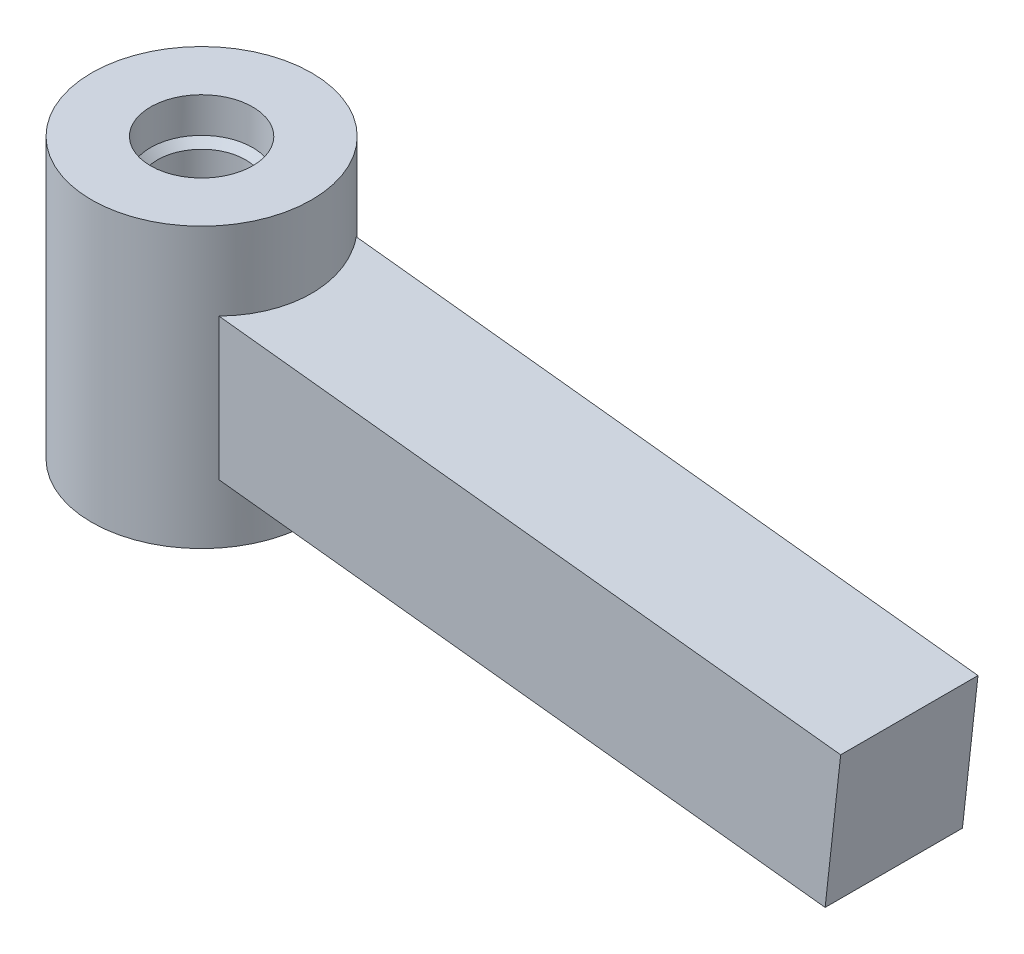
ISO-10303-21;
HEADER;
FILE_DESCRIPTION(('STEP AP214'),'2;1');
FILE_NAME('part.step','',(''),(''),'','','');
FILE_SCHEMA(('AUTOMOTIVE_DESIGN { 1 0 10303 214 1 1 1 1 }'));
ENDSEC;
DATA;
#1=APPLICATION_CONTEXT('core data for automotive mechanical design processes');
#2=APPLICATION_PROTOCOL_DEFINITION('international standard','automotive_design',2000,#1);
#3=PRODUCT_CONTEXT('',#1,'mechanical');
#4=PRODUCT('Part','Part','',(#3));
#5=PRODUCT_RELATED_PRODUCT_CATEGORY('part','',(#4));
#6=PRODUCT_DEFINITION_FORMATION('','',#4);
#7=PRODUCT_DEFINITION_CONTEXT('part definition',#1,'design');
#8=PRODUCT_DEFINITION('design','',#6,#7);
#9=PRODUCT_DEFINITION_SHAPE('','',#8);
#10=(LENGTH_UNIT() NAMED_UNIT(*) SI_UNIT(.MILLI.,.METRE.));
#11=(NAMED_UNIT(*) PLANE_ANGLE_UNIT() SI_UNIT($,.RADIAN.));
#12=(NAMED_UNIT(*) SI_UNIT($,.STERADIAN.) SOLID_ANGLE_UNIT());
#13=UNCERTAINTY_MEASURE_WITH_UNIT(LENGTH_MEASURE(1.E-05),#10,'distance_accuracy_value','');
#14=(GEOMETRIC_REPRESENTATION_CONTEXT(3) GLOBAL_UNCERTAINTY_ASSIGNED_CONTEXT((#13)) GLOBAL_UNIT_ASSIGNED_CONTEXT((#10,
#11,#12)) REPRESENTATION_CONTEXT('',''));
#15=CARTESIAN_POINT('',(0.,0.,0.));
#16=DIRECTION('',(0.,0.,1.));
#17=DIRECTION('',(1.,0.,0.));
#18=AXIS2_PLACEMENT_3D('',#15,#16,#17);
#19=CARTESIAN_POINT('',(0.,-10.0711,0.));
#20=DIRECTION('',(0.,1.,0.));
#21=DIRECTION('',(0.,0.,1.));
#22=AXIS2_PLACEMENT_3D('',#19,#20,#21);
#23=CYLINDRICAL_SURFACE('',#22,3.68300000002364);
#24=CARTESIAN_POINT('',(0.,-7.53110000005108,0.));
#25=DIRECTION('',(0.,-1.,0.));
#26=DIRECTION('',(0.,0.,-1.));
#27=AXIS2_PLACEMENT_3D('',#24,#25,#26);
#28=CIRCLE('',#27,3.68300000002364);
#29=CARTESIAN_POINT('',(0.,-7.53110000005108,-3.68300000002364));
#30=VERTEX_POINT('',#29);
#31=EDGE_CURVE('E124',#30,#30,#28,.F.);
#32=ORIENTED_EDGE('',*,*,#31,.T.);
#33=EDGE_LOOP('',(#32));
#34=FACE_BOUND('',#33,.T.);
#35=CARTESIAN_POINT('',(0.,-10.0711,0.));
#36=DIRECTION('',(0.,1.,0.));
#37=DIRECTION('',(0.,0.,1.));
#38=AXIS2_PLACEMENT_3D('',#35,#36,#37);
#39=CIRCLE('',#38,3.68300000002364);
#40=CARTESIAN_POINT('',(0.,-10.0711,3.68300000002364));
#41=VERTEX_POINT('',#40);
#42=EDGE_CURVE('E102',#41,#41,#39,.T.);
#43=ORIENTED_EDGE('',*,*,#42,.F.);
#44=EDGE_LOOP('',(#43));
#45=FACE_BOUND('',#44,.T.);
#46=ADVANCED_FACE('F41',(#34,#45),#23,.F.);
#47=CARTESIAN_POINT('',(0.,-10.0711,0.));
#48=DIRECTION('',(0.,1.,0.));
#49=DIRECTION('',(0.,0.,1.));
#50=AXIS2_PLACEMENT_3D('',#47,#48,#49);
#51=CYLINDRICAL_SURFACE('',#50,7.9375);
#52=CARTESIAN_POINT('',(0.,10.0711,0.));
#53=DIRECTION('',(0.,1.,0.));
#54=DIRECTION('',(0.,0.,1.));
#55=AXIS2_PLACEMENT_3D('',#52,#53,#54);
#56=CIRCLE('',#55,7.9375);
#57=CARTESIAN_POINT('',(0.,10.0711,7.9375));
#58=VERTEX_POINT('',#57);
#59=EDGE_CURVE('E174',#58,#58,#56,.T.);
#60=ORIENTED_EDGE('',*,*,#59,.F.);
#61=EDGE_LOOP('',(#60));
#62=FACE_BOUND('',#61,.T.);
#63=CARTESIAN_POINT('',(0.,-10.0711,0.));
#64=DIRECTION('',(0.,1.,0.));
#65=DIRECTION('',(0.,0.,1.));
#66=AXIS2_PLACEMENT_3D('',#63,#64,#65);
#67=CIRCLE('',#66,7.9375);
#68=CARTESIAN_POINT('',(0.,-10.0711,7.9375));
#69=VERTEX_POINT('',#68);
#70=EDGE_CURVE('E99',#69,#69,#67,.T.);
#71=ORIENTED_EDGE('',*,*,#70,.T.);
#72=EDGE_LOOP('',(#71));
#73=FACE_BOUND('',#72,.T.);
#74=CARTESIAN_POINT('',(0.,-5.11125993296291,0.));
#75=DIRECTION('',(0.110428199945451,0.993884104237917,0.));
#76=DIRECTION('',(-0.993884104237917,0.110428199945451,0.));
#77=AXIS2_PLACEMENT_3D('',#74,#75,#76);
#78=ELLIPSE('',#77,7.98634364525455,7.9375);
#79=CARTESIAN_POINT('',(6.2025557030953,-5.80041177514817,4.953));
#80=VERTEX_POINT('',#79);
#81=CARTESIAN_POINT('',(6.2025557030953,-5.80041177514817,-4.953));
#82=VERTEX_POINT('',#81);
#83=EDGE_CURVE('E63',#80,#82,#78,.T.);
#84=ORIENTED_EDGE('',*,*,#83,.F.);
#85=DIRECTION('',(0.,1.,0.));
#86=VECTOR('',#85,1.);
#87=CARTESIAN_POINT('',(6.2025557030953,-10.0711,4.953));
#88=LINE('',#87,#86);
#89=CARTESIAN_POINT('',(6.2025557030953,4.42210809077765,4.953));
#90=VERTEX_POINT('',#89);
#91=EDGE_CURVE('E56',#80,#90,#88,.T.);
#92=ORIENTED_EDGE('',*,*,#91,.T.);
#93=CARTESIAN_POINT('',(0.,5.11125993296291,0.));
#94=DIRECTION('',(0.110428199945451,0.993884104237917,0.));
#95=DIRECTION('',(-0.993884104237917,0.110428199945451,0.));
#96=AXIS2_PLACEMENT_3D('',#93,#94,#95);
#97=ELLIPSE('',#96,7.98634364525455,7.9375);
#98=CARTESIAN_POINT('',(6.2025557030953,4.42210809077765,-4.953));
#99=VERTEX_POINT('',#98);
#100=EDGE_CURVE('E11',#90,#99,#97,.T.);
#101=ORIENTED_EDGE('',*,*,#100,.T.);
#102=DIRECTION('',(0.,1.,0.));
#103=VECTOR('',#102,1.);
#104=CARTESIAN_POINT('',(6.2025557030953,-10.0711,-4.953));
#105=LINE('',#104,#103);
#106=EDGE_CURVE('E93',#99,#82,#105,.F.);
#107=ORIENTED_EDGE('',*,*,#106,.T.);
#108=EDGE_LOOP('',(#84,#92,#101,#107));
#109=FACE_BOUND('',#108,.T.);
#110=ADVANCED_FACE('F98',(#62,#73,#109),#51,.T.);
#111=CARTESIAN_POINT('',(0.,-10.0711,0.));
#112=DIRECTION('',(0.,1.,0.));
#113=DIRECTION('',(0.,0.,1.));
#114=AXIS2_PLACEMENT_3D('',#111,#112,#113);
#115=PLANE('',#114);
#116=ORIENTED_EDGE('',*,*,#42,.T.);
#117=EDGE_LOOP('',(#116));
#118=FACE_BOUND('',#117,.T.);
#119=ORIENTED_EDGE('',*,*,#70,.F.);
#120=EDGE_LOOP('',(#119));
#121=FACE_BOUND('',#120,.T.);
#122=ADVANCED_FACE('F153',(#118,#121),#115,.F.);
#123=CARTESIAN_POINT('',(0.,7.53110000005108,0.));
#124=DIRECTION('',(0.,1.,0.));
#125=DIRECTION('',(-1.,0.,0.));
#126=AXIS2_PLACEMENT_3D('',#123,#124,#125);
#127=CIRCLE('',#126,3.68300000002364);
#128=CARTESIAN_POINT('',(-3.68300000002364,7.53110000005108,0.));
#129=VERTEX_POINT('',#128);
#130=EDGE_CURVE('E49',#129,#129,#127,.F.);
#131=ORIENTED_EDGE('',*,*,#130,.T.);
#132=EDGE_LOOP('',(#131));
#133=FACE_BOUND('',#132,.T.);
#134=CARTESIAN_POINT('',(0.,10.0711,0.));
#135=DIRECTION('',(0.,1.,0.));
#136=DIRECTION('',(0.,0.,1.));
#137=AXIS2_PLACEMENT_3D('',#134,#135,#136);
#138=CIRCLE('',#137,3.68300000002364);
#139=CARTESIAN_POINT('',(0.,10.0711,3.68300000002364));
#140=VERTEX_POINT('',#139);
#141=EDGE_CURVE('E172',#140,#140,#138,.T.);
#142=ORIENTED_EDGE('',*,*,#141,.T.);
#143=EDGE_LOOP('',(#142));
#144=FACE_BOUND('',#143,.T.);
#145=ADVANCED_FACE('F148',(#133,#144),#23,.F.);
#146=CARTESIAN_POINT('',(0.,10.0711,0.));
#147=DIRECTION('',(0.,1.,0.));
#148=DIRECTION('',(0.,0.,1.));
#149=AXIS2_PLACEMENT_3D('',#146,#147,#148);
#150=PLANE('',#149);
#151=ORIENTED_EDGE('',*,*,#59,.T.);
#152=EDGE_LOOP('',(#151));
#153=FACE_BOUND('',#152,.T.);
#154=ORIENTED_EDGE('',*,*,#141,.F.);
#155=EDGE_LOOP('',(#154));
#156=FACE_BOUND('',#155,.T.);
#157=ADVANCED_FACE('F159',(#153,#156),#150,.T.);
#158=CARTESIAN_POINT('',(49.9283372395633,-10.6586838067575,0.));
#159=DIRECTION('',(0.993884104237917,-0.110428199945451,0.));
#160=DIRECTION('',(0.110428199945451,0.993884104237918,0.));
#161=AXIS2_PLACEMENT_3D('',#158,#159,#160);
#162=PLANE('',#161);
#163=DIRECTION('',(0.110428199945451,0.993884104237917,0.));
#164=VECTOR('',#163,1.);
#165=CARTESIAN_POINT('',(49.9283372395633,-10.6586838067575,-4.953));
#166=LINE('',#165,#164);
#167=CARTESIAN_POINT('',(49.9283372395633,-10.6586838067575,-4.953));
#168=VERTEX_POINT('',#167);
#169=CARTESIAN_POINT('',(51.0502877510091,-0.560821307700301,-4.953));
#170=VERTEX_POINT('',#169);
#171=EDGE_CURVE('E116',#168,#170,#166,.T.);
#172=ORIENTED_EDGE('',*,*,#171,.T.);
#173=DIRECTION('',(0.,0.,-1.));
#174=VECTOR('',#173,1.);
#175=CARTESIAN_POINT('',(51.0502877510091,-0.560821307700301,0.));
#176=LINE('',#175,#174);
#177=CARTESIAN_POINT('',(51.0502877510091,-0.560821307700301,4.953));
#178=VERTEX_POINT('',#177);
#179=EDGE_CURVE('E88',#178,#170,#176,.T.);
#180=ORIENTED_EDGE('',*,*,#179,.F.);
#181=DIRECTION('',(0.110428199945451,0.993884104237917,0.));
#182=VECTOR('',#181,1.);
#183=CARTESIAN_POINT('',(49.9283372395633,-10.6586838067575,4.953));
#184=LINE('',#183,#182);
#185=CARTESIAN_POINT('',(49.9283372395633,-10.6586838067575,4.953));
#186=VERTEX_POINT('',#185);
#187=EDGE_CURVE('E115',#186,#178,#184,.T.);
#188=ORIENTED_EDGE('',*,*,#187,.F.);
#189=DIRECTION('',(0.,0.,-1.));
#190=VECTOR('',#189,1.);
#191=CARTESIAN_POINT('',(49.9283372395633,-10.6586838067575,0.));
#192=LINE('',#191,#190);
#193=EDGE_CURVE('E111',#186,#168,#192,.T.);
#194=ORIENTED_EDGE('',*,*,#193,.T.);
#195=EDGE_LOOP('',(#172,#180,#188,#194));
#196=FACE_BOUND('',#195,.T.);
#197=ADVANCED_FACE('F165',(#196),#162,.T.);
#198=CARTESIAN_POINT('',(0.560975255722892,5.04893124952862,0.));
#199=DIRECTION('',(0.110428199945451,0.993884104237917,0.));
#200=DIRECTION('',(-0.993884104237917,0.110428199945451,0.));
#201=AXIS2_PLACEMENT_3D('',#198,#199,#200);
#202=PLANE('',#201);
#203=ORIENTED_EDGE('',*,*,#100,.F.);
#204=DIRECTION('',(0.993884104237917,-0.110428199945451,0.));
#205=VECTOR('',#204,1.);
#206=CARTESIAN_POINT('',(0.560975255722893,5.04893124952862,4.953));
#207=LINE('',#206,#205);
#208=EDGE_CURVE('E107',#90,#178,#207,.T.);
#209=ORIENTED_EDGE('',*,*,#208,.T.);
#210=ORIENTED_EDGE('',*,*,#179,.T.);
#211=DIRECTION('',(-0.993884104237917,0.110428199945451,0.));
#212=VECTOR('',#211,1.);
#213=CARTESIAN_POINT('',(0.560975255722892,5.04893124952862,-4.953));
#214=LINE('',#213,#212);
#215=EDGE_CURVE('E84',#170,#99,#214,.T.);
#216=ORIENTED_EDGE('',*,*,#215,.T.);
#217=EDGE_LOOP('',(#203,#209,#210,#216));
#218=FACE_BOUND('',#217,.T.);
#219=ADVANCED_FACE('F86',(#218),#202,.T.);
#220=CARTESIAN_POINT('',(-0.560975255722892,-5.04893124952862,0.));
#221=DIRECTION('',(0.110428199945451,0.993884104237917,0.));
#222=DIRECTION('',(-0.993884104237917,0.110428199945451,0.));
#223=AXIS2_PLACEMENT_3D('',#220,#221,#222);
#224=PLANE('',#223);
#225=DIRECTION('',(0.993884104237917,-0.110428199945451,0.));
#226=VECTOR('',#225,1.);
#227=CARTESIAN_POINT('',(-0.560975255722892,-5.04893124952862,4.953));
#228=LINE('',#227,#226);
#229=EDGE_CURVE('E90',#80,#186,#228,.T.);
#230=ORIENTED_EDGE('',*,*,#229,.F.);
#231=ORIENTED_EDGE('',*,*,#83,.T.);
#232=DIRECTION('',(-0.993884104237917,0.110428199945451,0.));
#233=VECTOR('',#232,1.);
#234=CARTESIAN_POINT('',(-0.560975255722892,-5.04893124952862,-4.953));
#235=LINE('',#234,#233);
#236=EDGE_CURVE('E95',#168,#82,#235,.T.);
#237=ORIENTED_EDGE('',*,*,#236,.F.);
#238=ORIENTED_EDGE('',*,*,#193,.F.);
#239=EDGE_LOOP('',(#230,#231,#237,#238));
#240=FACE_BOUND('',#239,.T.);
#241=ADVANCED_FACE('F195',(#240),#224,.F.);
#242=CARTESIAN_POINT('',(-0.560975255722892,-5.04893124952862,4.953));
#243=DIRECTION('',(0.,0.,1.));
#244=DIRECTION('',(1.,0.,0.));
#245=AXIS2_PLACEMENT_3D('',#242,#243,#244);
#246=PLANE('',#245);
#247=ORIENTED_EDGE('',*,*,#91,.F.);
#248=ORIENTED_EDGE('',*,*,#229,.T.);
#249=ORIENTED_EDGE('',*,*,#187,.T.);
#250=ORIENTED_EDGE('',*,*,#208,.F.);
#251=EDGE_LOOP('',(#247,#248,#249,#250));
#252=FACE_BOUND('',#251,.T.);
#253=ADVANCED_FACE('F144',(#252),#246,.T.);
#254=CARTESIAN_POINT('',(-0.560975255722892,-5.04893124952862,-4.953));
#255=DIRECTION('',(0.,0.,-1.));
#256=DIRECTION('',(-1.,0.,0.));
#257=AXIS2_PLACEMENT_3D('',#254,#255,#256);
#258=PLANE('',#257);
#259=ORIENTED_EDGE('',*,*,#106,.F.);
#260=ORIENTED_EDGE('',*,*,#215,.F.);
#261=ORIENTED_EDGE('',*,*,#171,.F.);
#262=ORIENTED_EDGE('',*,*,#236,.T.);
#263=EDGE_LOOP('',(#259,#260,#261,#262));
#264=FACE_BOUND('',#263,.T.);
#265=ADVANCED_FACE('F94',(#264),#258,.T.);
#266=CARTESIAN_POINT('',(0.,0.,0.));
#267=DIRECTION('',(0.,1.,0.));
#268=DIRECTION('',(0.,0.,1.));
#269=AXIS2_PLACEMENT_3D('',#266,#267,#268);
#270=CYLINDRICAL_SURFACE('',#269,3.175);
#271=CARTESIAN_POINT('',(0.,7.02310000002626,0.));
#272=DIRECTION('',(0.,1.,0.));
#273=DIRECTION('',(0.,0.,-1.));
#274=AXIS2_PLACEMENT_3D('',#271,#272,#273);
#275=CIRCLE('',#274,3.17499999999882);
#276=CARTESIAN_POINT('',(0.,7.02310000002626,-3.17499999999882));
#277=VERTEX_POINT('',#276);
#278=EDGE_CURVE('E121',#277,#277,#275,.T.);
#279=ORIENTED_EDGE('',*,*,#278,.T.);
#280=EDGE_LOOP('',(#279));
#281=FACE_BOUND('',#280,.T.);
#282=CARTESIAN_POINT('',(0.,-7.02310000002626,0.));
#283=DIRECTION('',(0.,-1.,0.));
#284=DIRECTION('',(0.,0.,-1.));
#285=AXIS2_PLACEMENT_3D('',#282,#283,#284);
#286=CIRCLE('',#285,3.17499999999882);
#287=CARTESIAN_POINT('',(0.,-7.02310000002626,-3.17499999999882));
#288=VERTEX_POINT('',#287);
#289=EDGE_CURVE('E118',#288,#288,#286,.T.);
#290=ORIENTED_EDGE('',*,*,#289,.T.);
#291=EDGE_LOOP('',(#290));
#292=FACE_BOUND('',#291,.T.);
#293=ADVANCED_FACE('F43',(#281,#292),#270,.F.);
#294=CARTESIAN_POINT('',(0.,-7.53110000010793,0.));
#295=DIRECTION('',(0.,-1.,0.));
#296=DIRECTION('',(0.,0.,-1.));
#297=AXIS2_PLACEMENT_3D('',#294,#295,#296);
#298=CONICAL_SURFACE('',#297,3.68300000008048,0.785398163397448);
#299=ORIENTED_EDGE('',*,*,#31,.F.);
#300=EDGE_LOOP('',(#299));
#301=FACE_BOUND('',#300,.T.);
#302=ORIENTED_EDGE('',*,*,#289,.F.);
#303=EDGE_LOOP('',(#302));
#304=FACE_BOUND('',#303,.T.);
#305=ADVANCED_FACE('F133',(#301,#304),#298,.F.);
#306=CARTESIAN_POINT('',(0.,7.53110000010793,0.));
#307=DIRECTION('',(0.,1.,0.));
#308=DIRECTION('',(-1.,0.,0.));
#309=AXIS2_PLACEMENT_3D('',#306,#307,#308);
#310=CONICAL_SURFACE('',#309,3.68300000008048,0.785398163397448);
#311=ORIENTED_EDGE('',*,*,#130,.F.);
#312=EDGE_LOOP('',(#311));
#313=FACE_BOUND('',#312,.T.);
#314=ORIENTED_EDGE('',*,*,#278,.F.);
#315=EDGE_LOOP('',(#314));
#316=FACE_BOUND('',#315,.T.);
#317=ADVANCED_FACE('F136',(#313,#316),#310,.F.);
#318=CLOSED_SHELL('',(#46,#110,#122,#145,#157,#197,#219,#241,#253,#265,#293,#305,#317));
#319=MANIFOLD_SOLID_BREP('B2',#318);
#320=ADVANCED_BREP_SHAPE_REPRESENTATION('',(#18,#319),#14);
#321=SHAPE_DEFINITION_REPRESENTATION(#9,#320);
ENDSEC;
END-ISO-10303-21;
